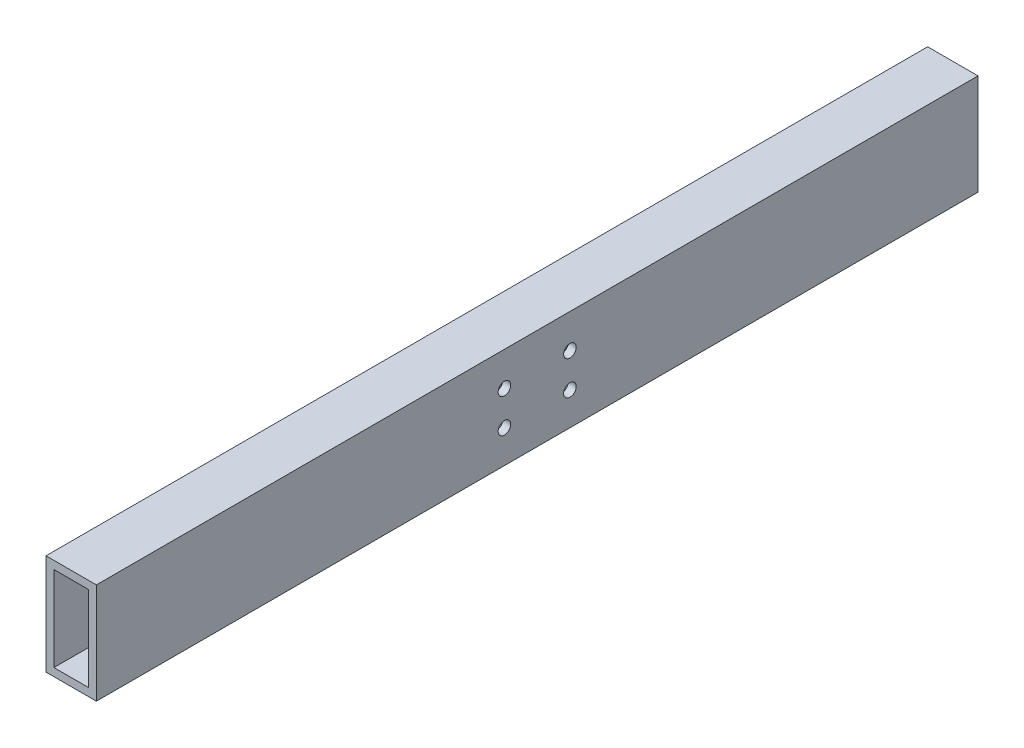
ISO-10303-21;
HEADER;
FILE_DESCRIPTION(('STEP AP214'),'2;1');
FILE_NAME('part.step','',(''),(''),'','','');
FILE_SCHEMA(('AUTOMOTIVE_DESIGN { 1 0 10303 214 1 1 1 1 }'));
ENDSEC;
DATA;
#1=APPLICATION_CONTEXT('core data for automotive mechanical design processes');
#2=APPLICATION_PROTOCOL_DEFINITION('international standard','automotive_design',2000,#1);
#3=PRODUCT_CONTEXT('',#1,'mechanical');
#4=PRODUCT('Part','Part','',(#3));
#5=PRODUCT_RELATED_PRODUCT_CATEGORY('part','',(#4));
#6=PRODUCT_DEFINITION_FORMATION('','',#4);
#7=PRODUCT_DEFINITION_CONTEXT('part definition',#1,'design');
#8=PRODUCT_DEFINITION('design','',#6,#7);
#9=PRODUCT_DEFINITION_SHAPE('','',#8);
#10=(LENGTH_UNIT() NAMED_UNIT(*) SI_UNIT(.MILLI.,.METRE.));
#11=(NAMED_UNIT(*) PLANE_ANGLE_UNIT() SI_UNIT($,.RADIAN.));
#12=(NAMED_UNIT(*) SI_UNIT($,.STERADIAN.) SOLID_ANGLE_UNIT());
#13=UNCERTAINTY_MEASURE_WITH_UNIT(LENGTH_MEASURE(1.E-05),#10,'distance_accuracy_value','');
#14=(GEOMETRIC_REPRESENTATION_CONTEXT(3) GLOBAL_UNCERTAINTY_ASSIGNED_CONTEXT((#13)) GLOBAL_UNIT_ASSIGNED_CONTEXT((#10,
#11,#12)) REPRESENTATION_CONTEXT('',''));
#15=CARTESIAN_POINT('',(0.,0.,0.));
#16=DIRECTION('',(0.,0.,1.));
#17=DIRECTION('',(1.,0.,0.));
#18=AXIS2_PLACEMENT_3D('',#15,#16,#17);
#19=CARTESIAN_POINT('',(-20.,40.,350.));
#20=DIRECTION('',(1.,0.,0.));
#21=DIRECTION('',(0.,0.,-1.));
#22=AXIS2_PLACEMENT_3D('',#19,#20,#21);
#23=PLANE('',#22);
#24=CARTESIAN_POINT('',(-20.,13.,26.));
#25=DIRECTION('',(1.,0.,0.));
#26=DIRECTION('',(0.,0.,-1.));
#27=AXIS2_PLACEMENT_3D('',#24,#25,#26);
#28=CIRCLE('',#27,4.99999999999999);
#29=CARTESIAN_POINT('',(-20.,13.,21.));
#30=VERTEX_POINT('',#29);
#31=EDGE_CURVE('E411',#30,#30,#28,.T.);
#32=ORIENTED_EDGE('',*,*,#31,.T.);
#33=EDGE_LOOP('',(#32));
#34=FACE_BOUND('',#33,.T.);
#35=CARTESIAN_POINT('',(-20.,-14.,26.));
#36=DIRECTION('',(1.,0.,0.));
#37=DIRECTION('',(0.,0.,-1.));
#38=AXIS2_PLACEMENT_3D('',#35,#36,#37);
#39=CIRCLE('',#38,4.99999999999999);
#40=CARTESIAN_POINT('',(-20.,-14.,21.));
#41=VERTEX_POINT('',#40);
#42=EDGE_CURVE('E130',#41,#41,#39,.T.);
#43=ORIENTED_EDGE('',*,*,#42,.T.);
#44=EDGE_LOOP('',(#43));
#45=FACE_BOUND('',#44,.T.);
#46=CARTESIAN_POINT('',(-20.,13.,-26.));
#47=DIRECTION('',(1.,0.,0.));
#48=DIRECTION('',(0.,0.,-1.));
#49=AXIS2_PLACEMENT_3D('',#46,#47,#48);
#50=CIRCLE('',#49,4.99999999999999);
#51=CARTESIAN_POINT('',(-20.,13.,-31.));
#52=VERTEX_POINT('',#51);
#53=EDGE_CURVE('E126',#52,#52,#50,.T.);
#54=ORIENTED_EDGE('',*,*,#53,.T.);
#55=EDGE_LOOP('',(#54));
#56=FACE_BOUND('',#55,.T.);
#57=CARTESIAN_POINT('',(-20.,-14.,-26.));
#58=DIRECTION('',(1.,0.,0.));
#59=DIRECTION('',(0.,0.,-1.));
#60=AXIS2_PLACEMENT_3D('',#57,#58,#59);
#61=CIRCLE('',#60,4.99999999999999);
#62=CARTESIAN_POINT('',(-20.,-14.,-31.));
#63=VERTEX_POINT('',#62);
#64=EDGE_CURVE('E155',#63,#63,#61,.T.);
#65=ORIENTED_EDGE('',*,*,#64,.T.);
#66=EDGE_LOOP('',(#65));
#67=FACE_BOUND('',#66,.T.);
#68=DIRECTION('',(0.,0.,-1.));
#69=VECTOR('',#68,1.);
#70=CARTESIAN_POINT('',(-20.,-40.,350.));
#71=LINE('',#70,#69);
#72=CARTESIAN_POINT('',(-20.,-40.,350.));
#73=VERTEX_POINT('',#72);
#74=CARTESIAN_POINT('',(-20.,-40.,-350.));
#75=VERTEX_POINT('',#74);
#76=EDGE_CURVE('E100',#73,#75,#71,.T.);
#77=ORIENTED_EDGE('',*,*,#76,.F.);
#78=DIRECTION('',(0.,-1.,0.));
#79=VECTOR('',#78,1.);
#80=CARTESIAN_POINT('',(-20.,40.,350.));
#81=LINE('',#80,#79);
#82=CARTESIAN_POINT('',(-20.,40.,350.));
#83=VERTEX_POINT('',#82);
#84=EDGE_CURVE('E88',#83,#73,#81,.T.);
#85=ORIENTED_EDGE('',*,*,#84,.F.);
#86=DIRECTION('',(0.,0.,-1.));
#87=VECTOR('',#86,1.);
#88=CARTESIAN_POINT('',(-20.,40.,350.));
#89=LINE('',#88,#87);
#90=CARTESIAN_POINT('',(-20.,40.,-350.));
#91=VERTEX_POINT('',#90);
#92=EDGE_CURVE('E105',#83,#91,#89,.T.);
#93=ORIENTED_EDGE('',*,*,#92,.T.);
#94=DIRECTION('',(0.,-1.,0.));
#95=VECTOR('',#94,1.);
#96=CARTESIAN_POINT('',(-20.,40.,-350.));
#97=LINE('',#96,#95);
#98=EDGE_CURVE('E101',#91,#75,#97,.T.);
#99=ORIENTED_EDGE('',*,*,#98,.T.);
#100=EDGE_LOOP('',(#77,#85,#93,#99));
#101=FACE_BOUND('',#100,.T.);
#102=ADVANCED_FACE('F36',(#34,#45,#56,#67,#101),#23,.F.);
#103=CARTESIAN_POINT('',(-20.,-40.,350.));
#104=DIRECTION('',(0.,1.,0.));
#105=DIRECTION('',(-1.,0.,0.));
#106=AXIS2_PLACEMENT_3D('',#103,#104,#105);
#107=PLANE('',#106);
#108=DIRECTION('',(0.,0.,-1.));
#109=VECTOR('',#108,1.);
#110=CARTESIAN_POINT('',(20.,-40.,350.));
#111=LINE('',#110,#109);
#112=CARTESIAN_POINT('',(20.,-40.,350.));
#113=VERTEX_POINT('',#112);
#114=CARTESIAN_POINT('',(20.,-40.,-350.));
#115=VERTEX_POINT('',#114);
#116=EDGE_CURVE('E104',#113,#115,#111,.T.);
#117=ORIENTED_EDGE('',*,*,#116,.F.);
#118=DIRECTION('',(1.,0.,0.));
#119=VECTOR('',#118,1.);
#120=CARTESIAN_POINT('',(-20.,-40.,350.));
#121=LINE('',#120,#119);
#122=EDGE_CURVE('E85',#73,#113,#121,.T.);
#123=ORIENTED_EDGE('',*,*,#122,.F.);
#124=ORIENTED_EDGE('',*,*,#76,.T.);
#125=DIRECTION('',(1.,0.,0.));
#126=VECTOR('',#125,1.);
#127=CARTESIAN_POINT('',(-20.,-40.,-350.));
#128=LINE('',#127,#126);
#129=EDGE_CURVE('E193',#75,#115,#128,.T.);
#130=ORIENTED_EDGE('',*,*,#129,.T.);
#131=EDGE_LOOP('',(#117,#123,#124,#130));
#132=FACE_BOUND('',#131,.T.);
#133=ADVANCED_FACE('F107',(#132),#107,.F.);
#134=CARTESIAN_POINT('',(20.,40.,350.));
#135=DIRECTION('',(-1.,0.,0.));
#136=DIRECTION('',(0.,-1.,0.));
#137=AXIS2_PLACEMENT_3D('',#134,#135,#136);
#138=PLANE('',#137);
#139=CARTESIAN_POINT('',(20.,13.,26.));
#140=DIRECTION('',(1.,0.,0.));
#141=DIRECTION('',(0.,0.,-1.));
#142=AXIS2_PLACEMENT_3D('',#139,#140,#141);
#143=CIRCLE('',#142,5.);
#144=CARTESIAN_POINT('',(20.,13.,21.));
#145=VERTEX_POINT('',#144);
#146=EDGE_CURVE('E408',#145,#145,#143,.T.);
#147=ORIENTED_EDGE('',*,*,#146,.F.);
#148=EDGE_LOOP('',(#147));
#149=FACE_BOUND('',#148,.T.);
#150=CARTESIAN_POINT('',(20.,-14.,26.));
#151=DIRECTION('',(1.,0.,0.));
#152=DIRECTION('',(0.,0.,-1.));
#153=AXIS2_PLACEMENT_3D('',#150,#151,#152);
#154=CIRCLE('',#153,5.);
#155=CARTESIAN_POINT('',(20.,-14.,21.));
#156=VERTEX_POINT('',#155);
#157=EDGE_CURVE('E137',#156,#156,#154,.T.);
#158=ORIENTED_EDGE('',*,*,#157,.F.);
#159=EDGE_LOOP('',(#158));
#160=FACE_BOUND('',#159,.T.);
#161=CARTESIAN_POINT('',(20.,13.,-26.));
#162=DIRECTION('',(1.,0.,0.));
#163=DIRECTION('',(0.,0.,-1.));
#164=AXIS2_PLACEMENT_3D('',#161,#162,#163);
#165=CIRCLE('',#164,5.);
#166=CARTESIAN_POINT('',(20.,13.,-31.));
#167=VERTEX_POINT('',#166);
#168=EDGE_CURVE('E134',#167,#167,#165,.T.);
#169=ORIENTED_EDGE('',*,*,#168,.F.);
#170=EDGE_LOOP('',(#169));
#171=FACE_BOUND('',#170,.T.);
#172=CARTESIAN_POINT('',(20.,-14.,-26.));
#173=DIRECTION('',(1.,0.,0.));
#174=DIRECTION('',(0.,0.,-1.));
#175=AXIS2_PLACEMENT_3D('',#172,#173,#174);
#176=CIRCLE('',#175,5.);
#177=CARTESIAN_POINT('',(20.,-14.,-31.));
#178=VERTEX_POINT('',#177);
#179=EDGE_CURVE('E152',#178,#178,#176,.T.);
#180=ORIENTED_EDGE('',*,*,#179,.F.);
#181=EDGE_LOOP('',(#180));
#182=FACE_BOUND('',#181,.T.);
#183=DIRECTION('',(0.,0.,-1.));
#184=VECTOR('',#183,1.);
#185=CARTESIAN_POINT('',(20.,40.,350.));
#186=LINE('',#185,#184);
#187=CARTESIAN_POINT('',(20.,40.,350.));
#188=VERTEX_POINT('',#187);
#189=CARTESIAN_POINT('',(20.,40.,-350.));
#190=VERTEX_POINT('',#189);
#191=EDGE_CURVE('E96',#188,#190,#186,.T.);
#192=ORIENTED_EDGE('',*,*,#191,.F.);
#193=DIRECTION('',(0.,1.,0.));
#194=VECTOR('',#193,1.);
#195=CARTESIAN_POINT('',(20.,40.,350.));
#196=LINE('',#195,#194);
#197=EDGE_CURVE('E110',#113,#188,#196,.T.);
#198=ORIENTED_EDGE('',*,*,#197,.F.);
#199=ORIENTED_EDGE('',*,*,#116,.T.);
#200=DIRECTION('',(0.,1.,0.));
#201=VECTOR('',#200,1.);
#202=CARTESIAN_POINT('',(20.,40.,-350.));
#203=LINE('',#202,#201);
#204=EDGE_CURVE('E114',#115,#190,#203,.T.);
#205=ORIENTED_EDGE('',*,*,#204,.T.);
#206=EDGE_LOOP('',(#192,#198,#199,#205));
#207=FACE_BOUND('',#206,.T.);
#208=ADVANCED_FACE('F200',(#149,#160,#171,#182,#207),#138,.F.);
#209=CARTESIAN_POINT('',(-20.,40.,350.));
#210=DIRECTION('',(0.,-1.,0.));
#211=DIRECTION('',(1.,0.,0.));
#212=AXIS2_PLACEMENT_3D('',#209,#210,#211);
#213=PLANE('',#212);
#214=DIRECTION('',(-1.,0.,0.));
#215=VECTOR('',#214,1.);
#216=CARTESIAN_POINT('',(-20.,40.,-350.));
#217=LINE('',#216,#215);
#218=EDGE_CURVE('E167',#190,#91,#217,.T.);
#219=ORIENTED_EDGE('',*,*,#218,.T.);
#220=ORIENTED_EDGE('',*,*,#92,.F.);
#221=DIRECTION('',(-1.,0.,0.));
#222=VECTOR('',#221,1.);
#223=CARTESIAN_POINT('',(-20.,40.,350.));
#224=LINE('',#223,#222);
#225=EDGE_CURVE('E92',#188,#83,#224,.T.);
#226=ORIENTED_EDGE('',*,*,#225,.F.);
#227=ORIENTED_EDGE('',*,*,#191,.T.);
#228=EDGE_LOOP('',(#219,#220,#226,#227));
#229=FACE_BOUND('',#228,.T.);
#230=ADVANCED_FACE('F38',(#229),#213,.F.);
#231=CARTESIAN_POINT('',(0.,0.,350.));
#232=DIRECTION('',(0.,0.,1.));
#233=DIRECTION('',(1.,0.,0.));
#234=AXIS2_PLACEMENT_3D('',#231,#232,#233);
#235=PLANE('',#234);
#236=DIRECTION('',(0.,-1.,0.));
#237=VECTOR('',#236,1.);
#238=CARTESIAN_POINT('',(-13.7,33.7,350.));
#239=LINE('',#238,#237);
#240=CARTESIAN_POINT('',(-13.7,-33.7,350.));
#241=VERTEX_POINT('',#240);
#242=CARTESIAN_POINT('',(-13.7,33.7,350.));
#243=VERTEX_POINT('',#242);
#244=EDGE_CURVE('E180',#241,#243,#239,.F.);
#245=ORIENTED_EDGE('',*,*,#244,.T.);
#246=DIRECTION('',(-1.,0.,0.));
#247=VECTOR('',#246,1.);
#248=CARTESIAN_POINT('',(-13.7,33.7,350.));
#249=LINE('',#248,#247);
#250=CARTESIAN_POINT('',(13.7,33.7,350.));
#251=VERTEX_POINT('',#250);
#252=EDGE_CURVE('E163',#243,#251,#249,.F.);
#253=ORIENTED_EDGE('',*,*,#252,.T.);
#254=DIRECTION('',(0.,1.,0.));
#255=VECTOR('',#254,1.);
#256=CARTESIAN_POINT('',(13.7,33.7,350.));
#257=LINE('',#256,#255);
#258=CARTESIAN_POINT('',(13.7,-33.7,350.));
#259=VERTEX_POINT('',#258);
#260=EDGE_CURVE('E166',#251,#259,#257,.F.);
#261=ORIENTED_EDGE('',*,*,#260,.T.);
#262=DIRECTION('',(1.,0.,0.));
#263=VECTOR('',#262,1.);
#264=CARTESIAN_POINT('',(-13.7,-33.7,350.));
#265=LINE('',#264,#263);
#266=EDGE_CURVE('E183',#259,#241,#265,.F.);
#267=ORIENTED_EDGE('',*,*,#266,.T.);
#268=EDGE_LOOP('',(#245,#253,#261,#267));
#269=FACE_BOUND('',#268,.T.);
#270=ORIENTED_EDGE('',*,*,#84,.T.);
#271=ORIENTED_EDGE('',*,*,#122,.T.);
#272=ORIENTED_EDGE('',*,*,#197,.T.);
#273=ORIENTED_EDGE('',*,*,#225,.T.);
#274=EDGE_LOOP('',(#270,#271,#272,#273));
#275=FACE_BOUND('',#274,.T.);
#276=ADVANCED_FACE('F90',(#269,#275),#235,.T.);
#277=CARTESIAN_POINT('',(0.,0.,-350.));
#278=DIRECTION('',(0.,0.,1.));
#279=DIRECTION('',(1.,0.,0.));
#280=AXIS2_PLACEMENT_3D('',#277,#278,#279);
#281=PLANE('',#280);
#282=DIRECTION('',(0.,-1.,0.));
#283=VECTOR('',#282,1.);
#284=CARTESIAN_POINT('',(-13.7,33.7,-350.));
#285=LINE('',#284,#283);
#286=CARTESIAN_POINT('',(-13.7,-33.7,-350.));
#287=VERTEX_POINT('',#286);
#288=CARTESIAN_POINT('',(-13.7,33.7,-350.));
#289=VERTEX_POINT('',#288);
#290=EDGE_CURVE('E11',#287,#289,#285,.F.);
#291=ORIENTED_EDGE('',*,*,#290,.F.);
#292=DIRECTION('',(1.,0.,0.));
#293=VECTOR('',#292,1.);
#294=CARTESIAN_POINT('',(-13.7,-33.7,-350.));
#295=LINE('',#294,#293);
#296=CARTESIAN_POINT('',(13.7,-33.7,-350.));
#297=VERTEX_POINT('',#296);
#298=EDGE_CURVE('E46',#297,#287,#295,.F.);
#299=ORIENTED_EDGE('',*,*,#298,.F.);
#300=DIRECTION('',(0.,1.,0.));
#301=VECTOR('',#300,1.);
#302=CARTESIAN_POINT('',(13.7,33.7,-350.));
#303=LINE('',#302,#301);
#304=CARTESIAN_POINT('',(13.7,33.7,-350.));
#305=VERTEX_POINT('',#304);
#306=EDGE_CURVE('E171',#305,#297,#303,.F.);
#307=ORIENTED_EDGE('',*,*,#306,.F.);
#308=DIRECTION('',(-1.,0.,0.));
#309=VECTOR('',#308,1.);
#310=CARTESIAN_POINT('',(-13.7,33.7,-350.));
#311=LINE('',#310,#309);
#312=EDGE_CURVE('E168',#289,#305,#311,.F.);
#313=ORIENTED_EDGE('',*,*,#312,.F.);
#314=EDGE_LOOP('',(#291,#299,#307,#313));
#315=FACE_BOUND('',#314,.T.);
#316=ORIENTED_EDGE('',*,*,#98,.F.);
#317=ORIENTED_EDGE('',*,*,#218,.F.);
#318=ORIENTED_EDGE('',*,*,#204,.F.);
#319=ORIENTED_EDGE('',*,*,#129,.F.);
#320=EDGE_LOOP('',(#316,#317,#318,#319));
#321=FACE_BOUND('',#320,.T.);
#322=ADVANCED_FACE('F202',(#315,#321),#281,.F.);
#323=CARTESIAN_POINT('',(-13.7,33.7,350.));
#324=DIRECTION('',(0.,1.,0.));
#325=DIRECTION('',(-1.,0.,0.));
#326=AXIS2_PLACEMENT_3D('',#323,#324,#325);
#327=PLANE('',#326);
#328=DIRECTION('',(0.,0.,-1.));
#329=VECTOR('',#328,1.);
#330=CARTESIAN_POINT('',(13.7,33.7,350.));
#331=LINE('',#330,#329);
#332=EDGE_CURVE('E173',#251,#305,#331,.T.);
#333=ORIENTED_EDGE('',*,*,#332,.F.);
#334=ORIENTED_EDGE('',*,*,#252,.F.);
#335=DIRECTION('',(0.,0.,-1.));
#336=VECTOR('',#335,1.);
#337=CARTESIAN_POINT('',(-13.7,33.7,350.));
#338=LINE('',#337,#336);
#339=EDGE_CURVE('E177',#243,#289,#338,.T.);
#340=ORIENTED_EDGE('',*,*,#339,.T.);
#341=ORIENTED_EDGE('',*,*,#312,.T.);
#342=EDGE_LOOP('',(#333,#334,#340,#341));
#343=FACE_BOUND('',#342,.T.);
#344=ADVANCED_FACE('F231',(#343),#327,.F.);
#345=CARTESIAN_POINT('',(13.7,33.7,350.));
#346=DIRECTION('',(1.,0.,0.));
#347=DIRECTION('',(0.,0.,-1.));
#348=AXIS2_PLACEMENT_3D('',#345,#346,#347);
#349=PLANE('',#348);
#350=CARTESIAN_POINT('',(13.7,13.,26.));
#351=DIRECTION('',(1.,0.,0.));
#352=DIRECTION('',(0.,0.,-1.));
#353=AXIS2_PLACEMENT_3D('',#350,#351,#352);
#354=CIRCLE('',#353,4.99999999999999);
#355=CARTESIAN_POINT('',(13.7,13.,21.));
#356=VERTEX_POINT('',#355);
#357=EDGE_CURVE('E142',#356,#356,#354,.T.);
#358=ORIENTED_EDGE('',*,*,#357,.T.);
#359=EDGE_LOOP('',(#358));
#360=FACE_BOUND('',#359,.T.);
#361=CARTESIAN_POINT('',(13.7,-14.,26.));
#362=DIRECTION('',(1.,0.,0.));
#363=DIRECTION('',(0.,0.,-1.));
#364=AXIS2_PLACEMENT_3D('',#361,#362,#363);
#365=CIRCLE('',#364,4.99999999999999);
#366=CARTESIAN_POINT('',(13.7,-14.,21.));
#367=VERTEX_POINT('',#366);
#368=EDGE_CURVE('E127',#367,#367,#365,.T.);
#369=ORIENTED_EDGE('',*,*,#368,.T.);
#370=EDGE_LOOP('',(#369));
#371=FACE_BOUND('',#370,.T.);
#372=CARTESIAN_POINT('',(13.7,13.,-26.));
#373=DIRECTION('',(1.,0.,0.));
#374=DIRECTION('',(0.,0.,-1.));
#375=AXIS2_PLACEMENT_3D('',#372,#373,#374);
#376=CIRCLE('',#375,4.99999999999999);
#377=CARTESIAN_POINT('',(13.7,13.,-31.));
#378=VERTEX_POINT('',#377);
#379=EDGE_CURVE('E125',#378,#378,#376,.T.);
#380=ORIENTED_EDGE('',*,*,#379,.T.);
#381=EDGE_LOOP('',(#380));
#382=FACE_BOUND('',#381,.T.);
#383=CARTESIAN_POINT('',(13.7,-14.,-26.));
#384=DIRECTION('',(1.,0.,0.));
#385=DIRECTION('',(0.,0.,-1.));
#386=AXIS2_PLACEMENT_3D('',#383,#384,#385);
#387=CIRCLE('',#386,4.99999999999999);
#388=CARTESIAN_POINT('',(13.7,-14.,-31.));
#389=VERTEX_POINT('',#388);
#390=EDGE_CURVE('E119',#389,#389,#387,.T.);
#391=ORIENTED_EDGE('',*,*,#390,.T.);
#392=EDGE_LOOP('',(#391));
#393=FACE_BOUND('',#392,.T.);
#394=DIRECTION('',(0.,0.,-1.));
#395=VECTOR('',#394,1.);
#396=CARTESIAN_POINT('',(13.7,-33.7,350.));
#397=LINE('',#396,#395);
#398=EDGE_CURVE('E176',#259,#297,#397,.T.);
#399=ORIENTED_EDGE('',*,*,#398,.F.);
#400=ORIENTED_EDGE('',*,*,#260,.F.);
#401=ORIENTED_EDGE('',*,*,#332,.T.);
#402=ORIENTED_EDGE('',*,*,#306,.T.);
#403=EDGE_LOOP('',(#399,#400,#401,#402));
#404=FACE_BOUND('',#403,.T.);
#405=ADVANCED_FACE('F224',(#360,#371,#382,#393,#404),#349,.F.);
#406=CARTESIAN_POINT('',(-13.7,-33.7,350.));
#407=DIRECTION('',(0.,-1.,0.));
#408=DIRECTION('',(1.,0.,0.));
#409=AXIS2_PLACEMENT_3D('',#406,#407,#408);
#410=PLANE('',#409);
#411=DIRECTION('',(0.,0.,-1.));
#412=VECTOR('',#411,1.);
#413=CARTESIAN_POINT('',(-13.7,-33.7,350.));
#414=LINE('',#413,#412);
#415=EDGE_CURVE('E172',#241,#287,#414,.T.);
#416=ORIENTED_EDGE('',*,*,#415,.F.);
#417=ORIENTED_EDGE('',*,*,#266,.F.);
#418=ORIENTED_EDGE('',*,*,#398,.T.);
#419=ORIENTED_EDGE('',*,*,#298,.T.);
#420=EDGE_LOOP('',(#416,#417,#418,#419));
#421=FACE_BOUND('',#420,.T.);
#422=ADVANCED_FACE('F214',(#421),#410,.F.);
#423=CARTESIAN_POINT('',(-13.7,33.7,350.));
#424=DIRECTION('',(-1.,0.,0.));
#425=DIRECTION('',(0.,0.,1.));
#426=AXIS2_PLACEMENT_3D('',#423,#424,#425);
#427=PLANE('',#426);
#428=CARTESIAN_POINT('',(-13.7,13.,26.));
#429=DIRECTION('',(-1.,0.,0.));
#430=DIRECTION('',(0.,0.,1.));
#431=AXIS2_PLACEMENT_3D('',#428,#429,#430);
#432=CIRCLE('',#431,4.99999999999999);
#433=CARTESIAN_POINT('',(-13.7,13.,31.));
#434=VERTEX_POINT('',#433);
#435=EDGE_CURVE('E40',#434,#434,#432,.T.);
#436=ORIENTED_EDGE('',*,*,#435,.T.);
#437=EDGE_LOOP('',(#436));
#438=FACE_BOUND('',#437,.T.);
#439=CARTESIAN_POINT('',(-13.7,-14.,26.));
#440=DIRECTION('',(-1.,0.,0.));
#441=DIRECTION('',(0.,0.,1.));
#442=AXIS2_PLACEMENT_3D('',#439,#440,#441);
#443=CIRCLE('',#442,4.99999999999999);
#444=CARTESIAN_POINT('',(-13.7,-14.,31.));
#445=VERTEX_POINT('',#444);
#446=EDGE_CURVE('E129',#445,#445,#443,.T.);
#447=ORIENTED_EDGE('',*,*,#446,.T.);
#448=EDGE_LOOP('',(#447));
#449=FACE_BOUND('',#448,.T.);
#450=CARTESIAN_POINT('',(-13.7,13.,-26.));
#451=DIRECTION('',(-1.,0.,0.));
#452=DIRECTION('',(0.,0.,1.));
#453=AXIS2_PLACEMENT_3D('',#450,#451,#452);
#454=CIRCLE('',#453,4.99999999999999);
#455=CARTESIAN_POINT('',(-13.7,13.,-21.));
#456=VERTEX_POINT('',#455);
#457=EDGE_CURVE('E123',#456,#456,#454,.T.);
#458=ORIENTED_EDGE('',*,*,#457,.T.);
#459=EDGE_LOOP('',(#458));
#460=FACE_BOUND('',#459,.T.);
#461=CARTESIAN_POINT('',(-13.7,-14.,-26.));
#462=DIRECTION('',(-1.,0.,0.));
#463=DIRECTION('',(0.,0.,1.));
#464=AXIS2_PLACEMENT_3D('',#461,#462,#463);
#465=CIRCLE('',#464,4.99999999999999);
#466=CARTESIAN_POINT('',(-13.7,-14.,-21.));
#467=VERTEX_POINT('',#466);
#468=EDGE_CURVE('E158',#467,#467,#465,.T.);
#469=ORIENTED_EDGE('',*,*,#468,.T.);
#470=EDGE_LOOP('',(#469));
#471=FACE_BOUND('',#470,.T.);
#472=ORIENTED_EDGE('',*,*,#290,.T.);
#473=ORIENTED_EDGE('',*,*,#339,.F.);
#474=ORIENTED_EDGE('',*,*,#244,.F.);
#475=ORIENTED_EDGE('',*,*,#415,.T.);
#476=EDGE_LOOP('',(#472,#473,#474,#475));
#477=FACE_BOUND('',#476,.T.);
#478=ADVANCED_FACE('F211',(#438,#449,#460,#471,#477),#427,.F.);
#479=CARTESIAN_POINT('',(20.,-14.,-26.));
#480=DIRECTION('',(1.,0.,0.));
#481=DIRECTION('',(0.,0.,-1.));
#482=AXIS2_PLACEMENT_3D('',#479,#480,#481);
#483=CYLINDRICAL_SURFACE('',#482,4.99999999999999);
#484=ORIENTED_EDGE('',*,*,#64,.F.);
#485=EDGE_LOOP('',(#484));
#486=FACE_BOUND('',#485,.T.);
#487=ORIENTED_EDGE('',*,*,#468,.F.);
#488=EDGE_LOOP('',(#487));
#489=FACE_BOUND('',#488,.T.);
#490=ADVANCED_FACE('F213',(#486,#489),#483,.F.);
#491=ORIENTED_EDGE('',*,*,#179,.T.);
#492=EDGE_LOOP('',(#491));
#493=FACE_BOUND('',#492,.T.);
#494=ORIENTED_EDGE('',*,*,#390,.F.);
#495=EDGE_LOOP('',(#494));
#496=FACE_BOUND('',#495,.T.);
#497=ADVANCED_FACE('F221',(#493,#496),#483,.F.);
#498=CARTESIAN_POINT('',(20.,13.,-26.));
#499=DIRECTION('',(1.,0.,0.));
#500=DIRECTION('',(0.,0.,-1.));
#501=AXIS2_PLACEMENT_3D('',#498,#499,#500);
#502=CYLINDRICAL_SURFACE('',#501,4.99999999999999);
#503=ORIENTED_EDGE('',*,*,#53,.F.);
#504=EDGE_LOOP('',(#503));
#505=FACE_BOUND('',#504,.T.);
#506=ORIENTED_EDGE('',*,*,#457,.F.);
#507=EDGE_LOOP('',(#506));
#508=FACE_BOUND('',#507,.T.);
#509=ADVANCED_FACE('F314',(#505,#508),#502,.F.);
#510=ORIENTED_EDGE('',*,*,#168,.T.);
#511=EDGE_LOOP('',(#510));
#512=FACE_BOUND('',#511,.T.);
#513=ORIENTED_EDGE('',*,*,#379,.F.);
#514=EDGE_LOOP('',(#513));
#515=FACE_BOUND('',#514,.T.);
#516=ADVANCED_FACE('F277',(#512,#515),#502,.F.);
#517=CARTESIAN_POINT('',(20.,-14.,26.));
#518=DIRECTION('',(1.,0.,0.));
#519=DIRECTION('',(0.,0.,-1.));
#520=AXIS2_PLACEMENT_3D('',#517,#518,#519);
#521=CYLINDRICAL_SURFACE('',#520,4.99999999999999);
#522=ORIENTED_EDGE('',*,*,#157,.T.);
#523=EDGE_LOOP('',(#522));
#524=FACE_BOUND('',#523,.T.);
#525=ORIENTED_EDGE('',*,*,#368,.F.);
#526=EDGE_LOOP('',(#525));
#527=FACE_BOUND('',#526,.T.);
#528=ADVANCED_FACE('F271',(#524,#527),#521,.F.);
#529=ORIENTED_EDGE('',*,*,#42,.F.);
#530=EDGE_LOOP('',(#529));
#531=FACE_BOUND('',#530,.T.);
#532=ORIENTED_EDGE('',*,*,#446,.F.);
#533=EDGE_LOOP('',(#532));
#534=FACE_BOUND('',#533,.T.);
#535=ADVANCED_FACE('F276',(#531,#534),#521,.F.);
#536=CARTESIAN_POINT('',(20.,13.,26.));
#537=DIRECTION('',(1.,0.,0.));
#538=DIRECTION('',(0.,0.,-1.));
#539=AXIS2_PLACEMENT_3D('',#536,#537,#538);
#540=CYLINDRICAL_SURFACE('',#539,4.99999999999999);
#541=ORIENTED_EDGE('',*,*,#31,.F.);
#542=EDGE_LOOP('',(#541));
#543=FACE_BOUND('',#542,.T.);
#544=ORIENTED_EDGE('',*,*,#435,.F.);
#545=EDGE_LOOP('',(#544));
#546=FACE_BOUND('',#545,.T.);
#547=ADVANCED_FACE('F289',(#543,#546),#540,.F.);
#548=ORIENTED_EDGE('',*,*,#146,.T.);
#549=EDGE_LOOP('',(#548));
#550=FACE_BOUND('',#549,.T.);
#551=ORIENTED_EDGE('',*,*,#357,.F.);
#552=EDGE_LOOP('',(#551));
#553=FACE_BOUND('',#552,.T.);
#554=ADVANCED_FACE('F298',(#550,#553),#540,.F.);
#555=CLOSED_SHELL('',(#102,#133,#208,#230,#276,#322,#344,#405,#422,#478,#490,#497,#509,#516,
#528,#535,#547,#554));
#556=MANIFOLD_SOLID_BREP('B2',#555);
#557=ADVANCED_BREP_SHAPE_REPRESENTATION('',(#18,#556),#14);
#558=SHAPE_DEFINITION_REPRESENTATION(#9,#557);
ENDSEC;
END-ISO-10303-21;
